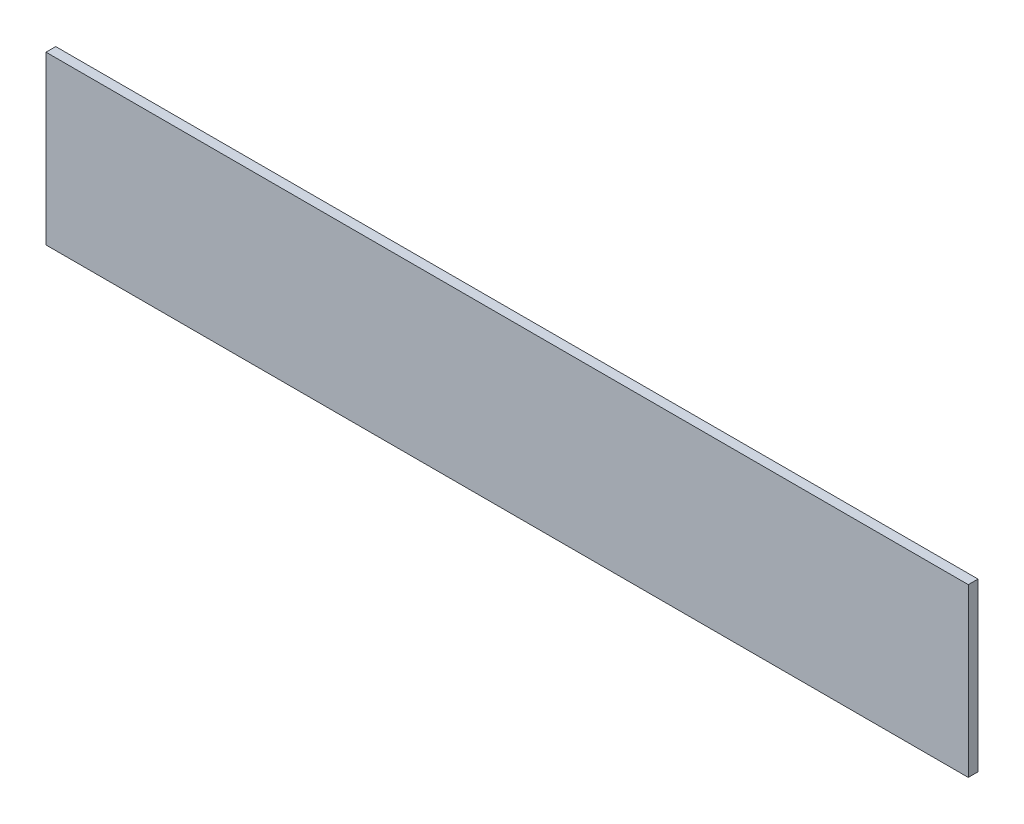
ISO-10303-21;
HEADER;
FILE_DESCRIPTION(('STEP AP214'),'2;1');
FILE_NAME('part.step','',(''),(''),'','','');
FILE_SCHEMA(('AUTOMOTIVE_DESIGN { 1 0 10303 214 1 1 1 1 }'));
ENDSEC;
DATA;
#1=APPLICATION_CONTEXT('core data for automotive mechanical design processes');
#2=APPLICATION_PROTOCOL_DEFINITION('international standard','automotive_design',2000,#1);
#3=PRODUCT_CONTEXT('',#1,'mechanical');
#4=PRODUCT('Part','Part','',(#3));
#5=PRODUCT_RELATED_PRODUCT_CATEGORY('part','',(#4));
#6=PRODUCT_DEFINITION_FORMATION('','',#4);
#7=PRODUCT_DEFINITION_CONTEXT('part definition',#1,'design');
#8=PRODUCT_DEFINITION('design','',#6,#7);
#9=PRODUCT_DEFINITION_SHAPE('','',#8);
#10=(LENGTH_UNIT() NAMED_UNIT(*) SI_UNIT(.MILLI.,.METRE.));
#11=(NAMED_UNIT(*) PLANE_ANGLE_UNIT() SI_UNIT($,.RADIAN.));
#12=(NAMED_UNIT(*) SI_UNIT($,.STERADIAN.) SOLID_ANGLE_UNIT());
#13=UNCERTAINTY_MEASURE_WITH_UNIT(LENGTH_MEASURE(1.E-05),#10,'distance_accuracy_value','');
#14=(GEOMETRIC_REPRESENTATION_CONTEXT(3) GLOBAL_UNCERTAINTY_ASSIGNED_CONTEXT((#13)) GLOBAL_UNIT_ASSIGNED_CONTEXT((#10,
#11,#12)) REPRESENTATION_CONTEXT('',''));
#15=CARTESIAN_POINT('',(0.,0.,0.));
#16=DIRECTION('',(0.,0.,1.));
#17=DIRECTION('',(1.,0.,0.));
#18=AXIS2_PLACEMENT_3D('',#15,#16,#17);
#19=CARTESIAN_POINT('',(237.5,-43.,5.));
#20=DIRECTION('',(-1.,0.,0.));
#21=DIRECTION('',(0.,0.,1.));
#22=AXIS2_PLACEMENT_3D('',#19,#20,#21);
#23=PLANE('',#22);
#24=DIRECTION('',(0.,1.,0.));
#25=VECTOR('',#24,1.);
#26=CARTESIAN_POINT('',(237.5,-43.,0.));
#27=LINE('',#26,#25);
#28=CARTESIAN_POINT('',(237.5,-43.,0.));
#29=VERTEX_POINT('',#28);
#30=CARTESIAN_POINT('',(237.5,43.,0.));
#31=VERTEX_POINT('',#30);
#32=EDGE_CURVE('E100',#29,#31,#27,.T.);
#33=ORIENTED_EDGE('',*,*,#32,.T.);
#34=DIRECTION('',(0.,0.,-1.));
#35=VECTOR('',#34,1.);
#36=CARTESIAN_POINT('',(237.5,43.,5.));
#37=LINE('',#36,#35);
#38=CARTESIAN_POINT('',(237.5,43.,5.));
#39=VERTEX_POINT('',#38);
#40=EDGE_CURVE('E11',#39,#31,#37,.T.);
#41=ORIENTED_EDGE('',*,*,#40,.F.);
#42=DIRECTION('',(0.,1.,0.));
#43=VECTOR('',#42,1.);
#44=CARTESIAN_POINT('',(237.5,-43.,5.));
#45=LINE('',#44,#43);
#46=CARTESIAN_POINT('',(237.5,-43.,5.));
#47=VERTEX_POINT('',#46);
#48=EDGE_CURVE('E88',#47,#39,#45,.T.);
#49=ORIENTED_EDGE('',*,*,#48,.F.);
#50=DIRECTION('',(0.,0.,-1.));
#51=VECTOR('',#50,1.);
#52=CARTESIAN_POINT('',(237.5,-43.,5.));
#53=LINE('',#52,#51);
#54=EDGE_CURVE('E96',#47,#29,#53,.T.);
#55=ORIENTED_EDGE('',*,*,#54,.T.);
#56=EDGE_LOOP('',(#33,#41,#49,#55));
#57=FACE_BOUND('',#56,.T.);
#58=ADVANCED_FACE('F37',(#57),#23,.F.);
#59=CARTESIAN_POINT('',(-237.5,43.,5.));
#60=DIRECTION('',(0.,-1.,0.));
#61=DIRECTION('',(0.,0.,-1.));
#62=AXIS2_PLACEMENT_3D('',#59,#60,#61);
#63=PLANE('',#62);
#64=DIRECTION('',(-1.,0.,0.));
#65=VECTOR('',#64,1.);
#66=CARTESIAN_POINT('',(-237.5,43.,0.));
#67=LINE('',#66,#65);
#68=CARTESIAN_POINT('',(-237.5,43.,0.));
#69=VERTEX_POINT('',#68);
#70=EDGE_CURVE('E92',#31,#69,#67,.T.);
#71=ORIENTED_EDGE('',*,*,#70,.T.);
#72=DIRECTION('',(0.,0.,-1.));
#73=VECTOR('',#72,1.);
#74=CARTESIAN_POINT('',(-237.5,43.,5.));
#75=LINE('',#74,#73);
#76=CARTESIAN_POINT('',(-237.5,43.,5.));
#77=VERTEX_POINT('',#76);
#78=EDGE_CURVE('E45',#77,#69,#75,.T.);
#79=ORIENTED_EDGE('',*,*,#78,.F.);
#80=DIRECTION('',(-1.,0.,0.));
#81=VECTOR('',#80,1.);
#82=CARTESIAN_POINT('',(-237.5,43.,5.));
#83=LINE('',#82,#81);
#84=EDGE_CURVE('E83',#39,#77,#83,.T.);
#85=ORIENTED_EDGE('',*,*,#84,.F.);
#86=ORIENTED_EDGE('',*,*,#40,.T.);
#87=EDGE_LOOP('',(#71,#79,#85,#86));
#88=FACE_BOUND('',#87,.T.);
#89=ADVANCED_FACE('F91',(#88),#63,.F.);
#90=CARTESIAN_POINT('',(-237.5,-43.,5.));
#91=DIRECTION('',(1.,0.,0.));
#92=DIRECTION('',(0.,0.,-1.));
#93=AXIS2_PLACEMENT_3D('',#90,#91,#92);
#94=PLANE('',#93);
#95=DIRECTION('',(0.,-1.,0.));
#96=VECTOR('',#95,1.);
#97=CARTESIAN_POINT('',(-237.5,-43.,0.));
#98=LINE('',#97,#96);
#99=CARTESIAN_POINT('',(-237.5,-43.,0.));
#100=VERTEX_POINT('',#99);
#101=EDGE_CURVE('E70',#69,#100,#98,.T.);
#102=ORIENTED_EDGE('',*,*,#101,.T.);
#103=DIRECTION('',(0.,0.,-1.));
#104=VECTOR('',#103,1.);
#105=CARTESIAN_POINT('',(-237.5,-43.,5.));
#106=LINE('',#105,#104);
#107=CARTESIAN_POINT('',(-237.5,-43.,5.));
#108=VERTEX_POINT('',#107);
#109=EDGE_CURVE('E93',#108,#100,#106,.T.);
#110=ORIENTED_EDGE('',*,*,#109,.F.);
#111=DIRECTION('',(0.,-1.,0.));
#112=VECTOR('',#111,1.);
#113=CARTESIAN_POINT('',(-237.5,-43.,5.));
#114=LINE('',#113,#112);
#115=EDGE_CURVE('E86',#77,#108,#114,.T.);
#116=ORIENTED_EDGE('',*,*,#115,.F.);
#117=ORIENTED_EDGE('',*,*,#78,.T.);
#118=EDGE_LOOP('',(#102,#110,#116,#117));
#119=FACE_BOUND('',#118,.T.);
#120=ADVANCED_FACE('F94',(#119),#94,.F.);
#121=CARTESIAN_POINT('',(-237.5,-43.,5.));
#122=DIRECTION('',(0.,1.,0.));
#123=DIRECTION('',(0.,0.,1.));
#124=AXIS2_PLACEMENT_3D('',#121,#122,#123);
#125=PLANE('',#124);
#126=DIRECTION('',(1.,0.,0.));
#127=VECTOR('',#126,1.);
#128=CARTESIAN_POINT('',(-237.5,-43.,0.));
#129=LINE('',#128,#127);
#130=EDGE_CURVE('E76',#100,#29,#129,.T.);
#131=ORIENTED_EDGE('',*,*,#130,.T.);
#132=ORIENTED_EDGE('',*,*,#54,.F.);
#133=DIRECTION('',(1.,0.,0.));
#134=VECTOR('',#133,1.);
#135=CARTESIAN_POINT('',(-237.5,-43.,5.));
#136=LINE('',#135,#134);
#137=EDGE_CURVE('E53',#108,#47,#136,.T.);
#138=ORIENTED_EDGE('',*,*,#137,.F.);
#139=ORIENTED_EDGE('',*,*,#109,.T.);
#140=EDGE_LOOP('',(#131,#132,#138,#139));
#141=FACE_BOUND('',#140,.T.);
#142=ADVANCED_FACE('F107',(#141),#125,.F.);
#143=CARTESIAN_POINT('',(0.,0.,5.));
#144=DIRECTION('',(0.,0.,-1.));
#145=DIRECTION('',(-1.,0.,0.));
#146=AXIS2_PLACEMENT_3D('',#143,#144,#145);
#147=PLANE('',#146);
#148=ORIENTED_EDGE('',*,*,#48,.T.);
#149=ORIENTED_EDGE('',*,*,#84,.T.);
#150=ORIENTED_EDGE('',*,*,#115,.T.);
#151=ORIENTED_EDGE('',*,*,#137,.T.);
#152=EDGE_LOOP('',(#148,#149,#150,#151));
#153=FACE_BOUND('',#152,.T.);
#154=ADVANCED_FACE('F84',(#153),#147,.F.);
#155=CARTESIAN_POINT('',(0.,0.,0.));
#156=DIRECTION('',(0.,0.,-1.));
#157=DIRECTION('',(-1.,0.,0.));
#158=AXIS2_PLACEMENT_3D('',#155,#156,#157);
#159=PLANE('',#158);
#160=ORIENTED_EDGE('',*,*,#32,.F.);
#161=ORIENTED_EDGE('',*,*,#130,.F.);
#162=ORIENTED_EDGE('',*,*,#101,.F.);
#163=ORIENTED_EDGE('',*,*,#70,.F.);
#164=EDGE_LOOP('',(#160,#161,#162,#163));
#165=FACE_BOUND('',#164,.T.);
#166=ADVANCED_FACE('F110',(#165),#159,.T.);
#167=CLOSED_SHELL('',(#58,#89,#120,#142,#154,#166));
#168=MANIFOLD_SOLID_BREP('B2',#167);
#169=ADVANCED_BREP_SHAPE_REPRESENTATION('',(#18,#168),#14);
#170=SHAPE_DEFINITION_REPRESENTATION(#9,#169);
ENDSEC;
END-ISO-10303-21;
